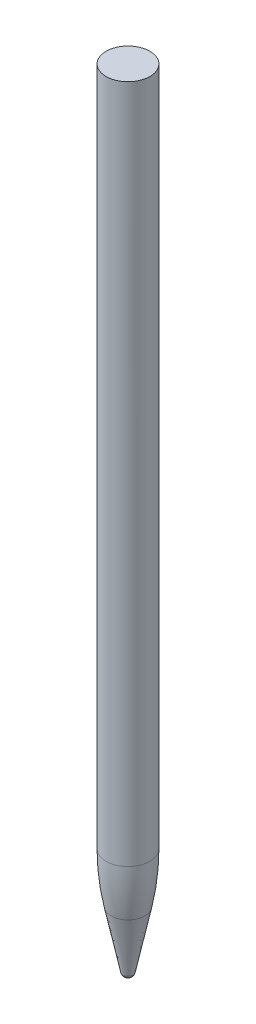
ISO-10303-21;
HEADER;
FILE_DESCRIPTION(('STEP AP214'),'2;1');
FILE_NAME('part.step','',(''),(''),'','','');
FILE_SCHEMA(('AUTOMOTIVE_DESIGN { 1 0 10303 214 1 1 1 1 }'));
ENDSEC;
DATA;
#1=APPLICATION_CONTEXT('core data for automotive mechanical design processes');
#2=APPLICATION_PROTOCOL_DEFINITION('international standard','automotive_design',2000,#1);
#3=PRODUCT_CONTEXT('',#1,'mechanical');
#4=PRODUCT('Part','Part','',(#3));
#5=PRODUCT_RELATED_PRODUCT_CATEGORY('part','',(#4));
#6=PRODUCT_DEFINITION_FORMATION('','',#4);
#7=PRODUCT_DEFINITION_CONTEXT('part definition',#1,'design');
#8=PRODUCT_DEFINITION('design','',#6,#7);
#9=PRODUCT_DEFINITION_SHAPE('','',#8);
#10=(LENGTH_UNIT() NAMED_UNIT(*) SI_UNIT(.MILLI.,.METRE.));
#11=(NAMED_UNIT(*) PLANE_ANGLE_UNIT() SI_UNIT($,.RADIAN.));
#12=(NAMED_UNIT(*) SI_UNIT($,.STERADIAN.) SOLID_ANGLE_UNIT());
#13=UNCERTAINTY_MEASURE_WITH_UNIT(LENGTH_MEASURE(1.E-05),#10,'distance_accuracy_value','');
#14=(GEOMETRIC_REPRESENTATION_CONTEXT(3) GLOBAL_UNCERTAINTY_ASSIGNED_CONTEXT((#13)) GLOBAL_UNIT_ASSIGNED_CONTEXT((#10,
#11,#12)) REPRESENTATION_CONTEXT('',''));
#15=CARTESIAN_POINT('',(0.,0.,0.));
#16=DIRECTION('',(0.,0.,1.));
#17=DIRECTION('',(1.,0.,0.));
#18=AXIS2_PLACEMENT_3D('',#15,#16,#17);
#19=CARTESIAN_POINT('',(0.,0.713567682611165,0.));
#20=DIRECTION('',(0.,1.,0.));
#21=DIRECTION('',(0.,0.,1.));
#22=AXIS2_PLACEMENT_3D('',#19,#20,#21);
#23=PLANE('',#22);
#24=CARTESIAN_POINT('',(0.,0.713567682611165,0.));
#25=DIRECTION('',(0.,1.,0.));
#26=DIRECTION('',(0.,0.,1.));
#27=AXIS2_PLACEMENT_3D('',#24,#25,#26);
#28=CIRCLE('',#27,0.0594940770157784);
#29=CARTESIAN_POINT('',(0.,0.713567682611165,0.0594940770157784));
#30=VERTEX_POINT('',#29);
#31=EDGE_CURVE('E42',#30,#30,#28,.F.);
#32=ORIENTED_EDGE('',*,*,#31,.T.);
#33=EDGE_LOOP('',(#32));
#34=FACE_BOUND('',#33,.T.);
#35=ADVANCED_FACE('F31',(#34),#23,.F.);
#36=CARTESIAN_POINT('',(0.,18.,0.));
#37=DIRECTION('',(0.,1.,0.));
#38=DIRECTION('',(0.,0.,1.));
#39=AXIS2_PLACEMENT_3D('',#36,#37,#38);
#40=CONICAL_SURFACE('',#39,4.425,0.202547287407364);
#41=CARTESIAN_POINT('',(0.,13.0228053968479,0.));
#42=DIRECTION('',(0.,1.,0.));
#43=DIRECTION('',(0.,0.,1.));
#44=AXIS2_PLACEMENT_3D('',#41,#42,#43);
#45=CIRCLE('',#44,3.40286654199222);
#46=CARTESIAN_POINT('',(0.,13.0228053968479,3.40286654199222));
#47=VERTEX_POINT('',#46);
#48=EDGE_CURVE('E10',#47,#47,#45,.F.);
#49=CARTESIAN_POINT('',(0.,1.51240248781366,0.));
#50=DIRECTION('',(0.,1.,0.));
#51=DIRECTION('',(0.,0.,1.));
#52=AXIS2_PLACEMENT_3D('',#49,#50,#51);
#53=CIRCLE('',#52,1.03905140785562);
#54=CARTESIAN_POINT('',(0.,1.51240248781365,1.03905140785562));
#55=VERTEX_POINT('',#54);
#56=EDGE_CURVE('E46',#55,#55,#53,.T.);
#57=CARTESIAN_POINT('',(0.,13.0228053968479,3.40286654199222));
#58=CARTESIAN_POINT('',(0.,12.9029053665454,3.3782434676783));
#59=CARTESIAN_POINT('',(0.,12.783005336243,3.35362039336437));
#60=CARTESIAN_POINT('',(0.,12.5432052756381,3.30437424473653));
#61=CARTESIAN_POINT('',(0.,12.4233052453357,3.2797511704226));
#62=CARTESIAN_POINT('',(0.,12.1835051847308,3.23050502179476));
#63=CARTESIAN_POINT('',(0.,12.0636051544284,3.20588194748084));
#64=CARTESIAN_POINT('',(0.,11.8238050938235,3.15663579885299));
#65=CARTESIAN_POINT('',(0.,11.703905063521,3.13201272453907));
#66=CARTESIAN_POINT('',(0.,11.4641050029162,3.08276657591122));
#67=CARTESIAN_POINT('',(0.,11.3442049726137,3.0581435015973));
#68=CARTESIAN_POINT('',(0.,11.1044049120088,3.00889735296945));
#69=CARTESIAN_POINT('',(0.,10.9845048817064,2.98427427865553));
#70=CARTESIAN_POINT('',(0.,10.7447048211015,2.93502813002768));
#71=CARTESIAN_POINT('',(0.,10.6248047907991,2.91040505571376));
#72=CARTESIAN_POINT('',(0.,10.3850047301942,2.86115890708592));
#73=CARTESIAN_POINT('',(0.,10.2651046998918,2.83653583277199));
#74=CARTESIAN_POINT('',(0.,10.0253046392869,2.78728968414415));
#75=CARTESIAN_POINT('',(0.,9.90540460898444,2.76266660983022));
#76=CARTESIAN_POINT('',(0.,9.66560454837956,2.71342046120238));
#77=CARTESIAN_POINT('',(0.,9.54570451807712,2.68879738688846));
#78=CARTESIAN_POINT('',(0.,9.30590445747224,2.63955123826061));
#79=CARTESIAN_POINT('',(0.,9.1860044271698,2.61492816394669));
#80=CARTESIAN_POINT('',(0.,8.94620436656492,2.56568201531884));
#81=CARTESIAN_POINT('',(0.,8.82630433626248,2.54105894100492));
#82=CARTESIAN_POINT('',(0.,8.5865042756576,2.49181279237707));
#83=CARTESIAN_POINT('',(0.,8.46660424535516,2.46718971806315));
#84=CARTESIAN_POINT('',(0.,8.22680418475028,2.4179435694353));
#85=CARTESIAN_POINT('',(0.,8.10690415444784,2.39332049512138));
#86=CARTESIAN_POINT('',(0.,7.86710409384296,2.34407434649354));
#87=CARTESIAN_POINT('',(0.,7.74720406354052,2.31945127217961));
#88=CARTESIAN_POINT('',(0.,7.50740400293564,2.27020512355177));
#89=CARTESIAN_POINT('',(0.,7.3875039726332,2.24558204923784));
#90=CARTESIAN_POINT('',(0.,7.14770391202832,2.19633590061));
#91=CARTESIAN_POINT('',(0.,7.02780388172588,2.17171282629607));
#92=CARTESIAN_POINT('',(0.,6.788003821121,2.12246667766823));
#93=CARTESIAN_POINT('',(0.,6.66810379081856,2.09784360335431));
#94=CARTESIAN_POINT('',(0.,6.42830373021368,2.04859745472646));
#95=CARTESIAN_POINT('',(0.,6.30840369991124,2.02397438041254));
#96=CARTESIAN_POINT('',(0.,6.06860363930636,1.97472823178469));
#97=CARTESIAN_POINT('',(0.,5.94870360900392,1.95010515747077));
#98=CARTESIAN_POINT('',(0.,5.70890354839905,1.90085900884292));
#99=CARTESIAN_POINT('',(0.,5.5890035180966,1.876235934529));
#100=CARTESIAN_POINT('',(0.,5.34920345749173,1.82698978590115));
#101=CARTESIAN_POINT('',(0.,5.22930342718929,1.80236671158723));
#102=CARTESIAN_POINT('',(0.,4.98950336658441,1.75312056295939));
#103=CARTESIAN_POINT('',(0.,4.86960333628197,1.72849748864546));
#104=CARTESIAN_POINT('',(0.,4.62980327567709,1.67925134001762));
#105=CARTESIAN_POINT('',(0.,4.50990324537465,1.65462826570369));
#106=CARTESIAN_POINT('',(0.,4.27010318476977,1.60538211707585));
#107=CARTESIAN_POINT('',(0.,4.15020315446733,1.58075904276193));
#108=CARTESIAN_POINT('',(0.,3.91040309386245,1.53151289413408));
#109=CARTESIAN_POINT('',(0.,3.79050306356001,1.50688981982016));
#110=CARTESIAN_POINT('',(0.,3.55070300295513,1.45764367119231));
#111=CARTESIAN_POINT('',(0.,3.43080297265269,1.43302059687839));
#112=CARTESIAN_POINT('',(0.,3.19100291204781,1.38377444825054));
#113=CARTESIAN_POINT('',(0.,3.07110288174537,1.35915137393662));
#114=CARTESIAN_POINT('',(0.,2.83130282114049,1.30990522530877));
#115=CARTESIAN_POINT('',(0.,2.71140279083805,1.28528215099485));
#116=CARTESIAN_POINT('',(0.,2.47160273023317,1.23603600236701));
#117=CARTESIAN_POINT('',(0.,2.35170269993073,1.21141292805308));
#118=CARTESIAN_POINT('',(0.,2.11190263932585,1.16216677942524));
#119=CARTESIAN_POINT('',(0.,1.99200260902341,1.13754370511131));
#120=CARTESIAN_POINT('',(0.,1.75220254841853,1.08829755648347));
#121=CARTESIAN_POINT('',(0.,1.63230251811609,1.06367448216955));
#122=CARTESIAN_POINT('',(0.,1.51240248781365,1.03905140785562));
#123=B_SPLINE_CURVE_WITH_KNOTS('',3,(#57,#58,#59,#60,#61,#62,#63,#64,#65,#66,#67,#68,#69,#70,
#71,#72,#73,#74,#75,#76,#77,#78,#79,#80,#81,#82,#83,#84,#85,#86,#87,#88,#89,#90,#91,#92,#93,#94,
#95,#96,#97,#98,#99,#100,#101,#102,#103,#104,#105,#106,#107,#108,#109,#110,#111,#112,#113,#114,
#115,#116,#117,#118,#119,#120,#121,#122),.UNSPECIFIED.,.F.,.F.,(4,2,2,2,2,2,2,2,2,2,2,2,2,2,2,2,
2,2,2,2,2,2,2,2,2,2,2,2,2,2,2,2,4),(0.,0.367206777574644,0.734413555149289,1.10162033272393,
1.46882711029858,1.83603388787322,2.20324066544787,2.57044744302251,2.93765422059716,
3.3048609981718,3.67206777574645,4.03927455332109,4.40648133089573,4.77368810847038,
5.14089488604502,5.50810166361967,5.87530844119431,6.24251521876896,6.6097219963436,
6.97692877391825,7.34413555149289,7.71134232906754,8.07854910664218,8.44575588421682,
8.81296266179147,9.18016943936611,9.54737621694076,9.9145829945154,10.28178977209,
10.6489965496647,11.0162033272393,11.383410104814,11.7506168823886),.UNSPECIFIED.);
#124=EDGE_CURVE('BSEAM59',#47,#55,#123,.T.);
#125=ORIENTED_EDGE('',*,*,#48,.T.);
#126=ORIENTED_EDGE('',*,*,#56,.T.);
#127=ORIENTED_EDGE('',*,*,#124,.T.);
#128=ORIENTED_EDGE('',*,*,#124,.F.);
#129=EDGE_LOOP('',(#125,#127,#126,#128));
#130=FACE_BOUND('',#129,.T.);
#131=ADVANCED_FACE('F59',(#130),#40,.T.);
#132=CARTESIAN_POINT('',(0.,160.5,0.));
#133=DIRECTION('',(0.,1.,0.));
#134=DIRECTION('',(0.,0.,1.));
#135=AXIS2_PLACEMENT_3D('',#132,#133,#134);
#136=CYLINDRICAL_SURFACE('',#135,4.425);
#137=CARTESIAN_POINT('',(0.,23.0810651367233,0.));
#138=DIRECTION('',(0.,-1.,0.));
#139=DIRECTION('',(0.,0.,-1.));
#140=AXIS2_PLACEMENT_3D('',#137,#138,#139);
#141=CIRCLE('',#140,4.425);
#142=CARTESIAN_POINT('',(0.,23.0810651367233,-4.425));
#143=VERTEX_POINT('',#142);
#144=EDGE_CURVE('E38',#143,#143,#141,.F.);
#145=ORIENTED_EDGE('',*,*,#144,.T.);
#146=EDGE_LOOP('',(#145));
#147=FACE_BOUND('',#146,.T.);
#148=CARTESIAN_POINT('',(0.,160.5,0.));
#149=DIRECTION('',(0.,1.,0.));
#150=DIRECTION('',(0.,0.,1.));
#151=AXIS2_PLACEMENT_3D('',#148,#149,#150);
#152=CIRCLE('',#151,4.425);
#153=CARTESIAN_POINT('',(0.,160.5,4.425));
#154=VERTEX_POINT('',#153);
#155=EDGE_CURVE('E51',#154,#154,#152,.T.);
#156=ORIENTED_EDGE('',*,*,#155,.F.);
#157=EDGE_LOOP('',(#156));
#158=FACE_BOUND('',#157,.T.);
#159=ADVANCED_FACE('F57',(#147,#158),#136,.T.);
#160=CARTESIAN_POINT('',(0.,160.5,0.));
#161=DIRECTION('',(0.,-1.,0.));
#162=DIRECTION('',(0.,0.,-1.));
#163=AXIS2_PLACEMENT_3D('',#160,#161,#162);
#164=PLANE('',#163);
#165=ORIENTED_EDGE('',*,*,#155,.T.);
#166=EDGE_LOOP('',(#165));
#167=FACE_BOUND('',#166,.T.);
#168=ADVANCED_FACE('F55',(#167),#164,.F.);
#169=CARTESIAN_POINT('',(0.,1.71356768261116,0.));
#170=DIRECTION('',(0.,1.,0.));
#171=DIRECTION('',(0.,0.,1.));
#172=AXIS2_PLACEMENT_3D('',#169,#170,#171);
#173=DEGENERATE_TOROIDAL_SURFACE('',#172,0.0594940770157784,1.,.T.);
#174=ORIENTED_EDGE('',*,*,#31,.F.);
#175=EDGE_LOOP('',(#174));
#176=FACE_BOUND('',#175,.T.);
#177=ORIENTED_EDGE('',*,*,#56,.F.);
#178=EDGE_LOOP('',(#177));
#179=FACE_BOUND('',#178,.T.);
#180=ADVANCED_FACE('F65',(#176,#179),#173,.T.);
#181=CARTESIAN_POINT('',(0.,23.0810651367233,0.));
#182=DIRECTION('',(0.,-1.,0.));
#183=DIRECTION('',(0.,0.,-1.));
#184=AXIS2_PLACEMENT_3D('',#181,#182,#183);
#185=DEGENERATE_TOROIDAL_SURFACE('',#184,45.575,50.,.F.);
#186=ORIENTED_EDGE('',*,*,#48,.F.);
#187=EDGE_LOOP('',(#186));
#188=FACE_BOUND('',#187,.T.);
#189=ORIENTED_EDGE('',*,*,#144,.F.);
#190=EDGE_LOOP('',(#189));
#191=FACE_BOUND('',#190,.T.);
#192=ADVANCED_FACE('F33',(#188,#191),#185,.F.);
#193=CLOSED_SHELL('',(#35,#131,#159,#168,#180,#192));
#194=MANIFOLD_SOLID_BREP('B2',#193);
#195=ADVANCED_BREP_SHAPE_REPRESENTATION('',(#18,#194),#14);
#196=SHAPE_DEFINITION_REPRESENTATION(#9,#195);
ENDSEC;
END-ISO-10303-21;
